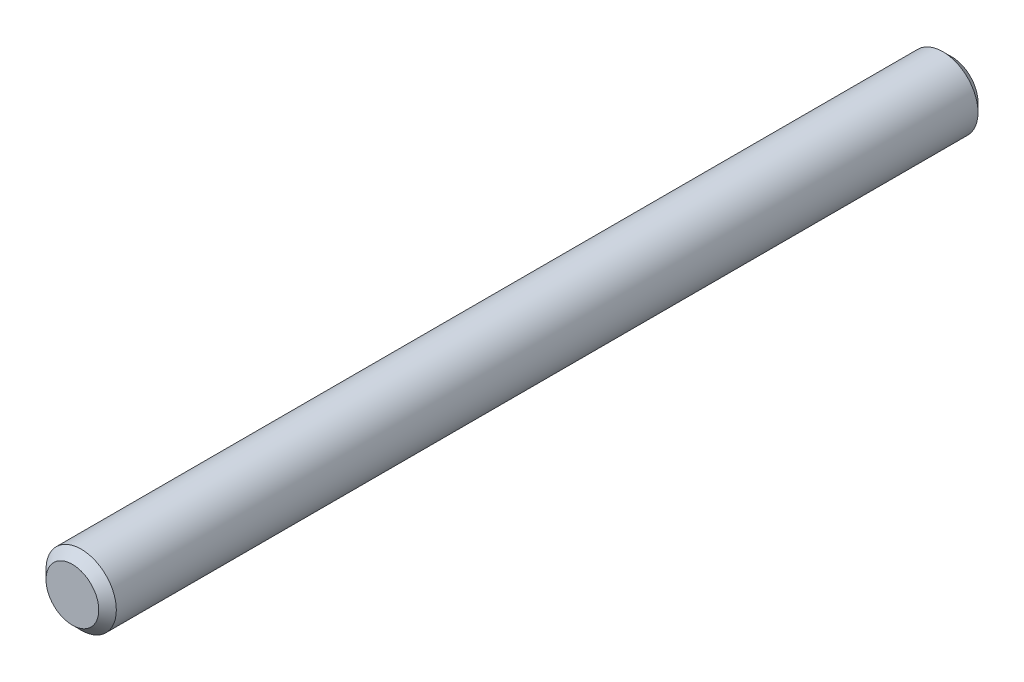
ISO-10303-21;
HEADER;
FILE_DESCRIPTION(('STEP AP214'),'2;1');
FILE_NAME('part.step','',(''),(''),'','','');
FILE_SCHEMA(('AUTOMOTIVE_DESIGN { 1 0 10303 214 1 1 1 1 }'));
ENDSEC;
DATA;
#1=APPLICATION_CONTEXT('core data for automotive mechanical design processes');
#2=APPLICATION_PROTOCOL_DEFINITION('international standard','automotive_design',2000,#1);
#3=PRODUCT_CONTEXT('',#1,'mechanical');
#4=PRODUCT('Part','Part','',(#3));
#5=PRODUCT_RELATED_PRODUCT_CATEGORY('part','',(#4));
#6=PRODUCT_DEFINITION_FORMATION('','',#4);
#7=PRODUCT_DEFINITION_CONTEXT('part definition',#1,'design');
#8=PRODUCT_DEFINITION('design','',#6,#7);
#9=PRODUCT_DEFINITION_SHAPE('','',#8);
#10=(LENGTH_UNIT() NAMED_UNIT(*) SI_UNIT(.MILLI.,.METRE.));
#11=(NAMED_UNIT(*) PLANE_ANGLE_UNIT() SI_UNIT($,.RADIAN.));
#12=(NAMED_UNIT(*) SI_UNIT($,.STERADIAN.) SOLID_ANGLE_UNIT());
#13=UNCERTAINTY_MEASURE_WITH_UNIT(LENGTH_MEASURE(1.E-05),#10,'distance_accuracy_value','');
#14=(GEOMETRIC_REPRESENTATION_CONTEXT(3) GLOBAL_UNCERTAINTY_ASSIGNED_CONTEXT((#13)) GLOBAL_UNIT_ASSIGNED_CONTEXT((#10,
#11,#12)) REPRESENTATION_CONTEXT('',''));
#15=CARTESIAN_POINT('',(0.,0.,0.));
#16=DIRECTION('',(0.,0.,1.));
#17=DIRECTION('',(1.,0.,0.));
#18=AXIS2_PLACEMENT_3D('',#15,#16,#17);
#19=CARTESIAN_POINT('',(0.,0.,25.));
#20=DIRECTION('',(0.,0.,-1.));
#21=DIRECTION('',(-1.,0.,0.));
#22=AXIS2_PLACEMENT_3D('',#19,#20,#21);
#23=CYLINDRICAL_SURFACE('',#22,2.);
#24=CARTESIAN_POINT('',(0.,0.,-24.5));
#25=DIRECTION('',(0.,0.,1.));
#26=DIRECTION('',(1.,0.,0.));
#27=AXIS2_PLACEMENT_3D('',#24,#25,#26);
#28=CIRCLE('',#27,2.);
#29=CARTESIAN_POINT('',(2.,0.,-24.5));
#30=VERTEX_POINT('',#29);
#31=EDGE_CURVE('E49',#30,#30,#28,.T.);
#32=ORIENTED_EDGE('',*,*,#31,.T.);
#33=EDGE_LOOP('',(#32));
#34=FACE_BOUND('',#33,.T.);
#35=CARTESIAN_POINT('',(0.,0.,24.5));
#36=DIRECTION('',(0.,0.,1.));
#37=DIRECTION('',(1.,0.,0.));
#38=AXIS2_PLACEMENT_3D('',#35,#36,#37);
#39=CIRCLE('',#38,2.);
#40=CARTESIAN_POINT('',(2.,0.,24.5));
#41=VERTEX_POINT('',#40);
#42=EDGE_CURVE('E53',#41,#41,#39,.F.);
#43=ORIENTED_EDGE('',*,*,#42,.T.);
#44=EDGE_LOOP('',(#43));
#45=FACE_BOUND('',#44,.T.);
#46=ADVANCED_FACE('F37',(#34,#45),#23,.T.);
#47=CARTESIAN_POINT('',(0.,0.,25.));
#48=DIRECTION('',(0.,0.,1.));
#49=DIRECTION('',(1.,0.,0.));
#50=AXIS2_PLACEMENT_3D('',#47,#48,#49);
#51=PLANE('',#50);
#52=CARTESIAN_POINT('',(0.,0.,25.));
#53=DIRECTION('',(0.,0.,1.));
#54=DIRECTION('',(1.,0.,0.));
#55=AXIS2_PLACEMENT_3D('',#52,#53,#54);
#56=CIRCLE('',#55,1.50000000000001);
#57=CARTESIAN_POINT('',(1.50000000000001,0.,25.));
#58=VERTEX_POINT('',#57);
#59=EDGE_CURVE('E10',#58,#58,#56,.T.);
#60=ORIENTED_EDGE('',*,*,#59,.T.);
#61=EDGE_LOOP('',(#60));
#62=FACE_BOUND('',#61,.T.);
#63=ADVANCED_FACE('F69',(#62),#51,.T.);
#64=CARTESIAN_POINT('',(0.,0.,-25.));
#65=DIRECTION('',(0.,0.,1.));
#66=DIRECTION('',(1.,0.,0.));
#67=AXIS2_PLACEMENT_3D('',#64,#65,#66);
#68=PLANE('',#67);
#69=CARTESIAN_POINT('',(0.,0.,-25.));
#70=DIRECTION('',(0.,0.,1.));
#71=DIRECTION('',(1.,0.,0.));
#72=AXIS2_PLACEMENT_3D('',#69,#70,#71);
#73=CIRCLE('',#72,1.49999999999999);
#74=CARTESIAN_POINT('',(1.49999999999999,0.,-25.));
#75=VERTEX_POINT('',#74);
#76=EDGE_CURVE('E45',#75,#75,#73,.F.);
#77=ORIENTED_EDGE('',*,*,#76,.T.);
#78=EDGE_LOOP('',(#77));
#79=FACE_BOUND('',#78,.T.);
#80=ADVANCED_FACE('F66',(#79),#68,.F.);
#81=CARTESIAN_POINT('',(0.,0.,-24.5));
#82=DIRECTION('',(0.,0.,1.));
#83=DIRECTION('',(1.,0.,0.));
#84=AXIS2_PLACEMENT_3D('',#81,#82,#83);
#85=CONICAL_SURFACE('',#84,2.,0.785398163397453);
#86=ORIENTED_EDGE('',*,*,#76,.F.);
#87=EDGE_LOOP('',(#86));
#88=FACE_BOUND('',#87,.T.);
#89=ORIENTED_EDGE('',*,*,#31,.F.);
#90=EDGE_LOOP('',(#89));
#91=FACE_BOUND('',#90,.T.);
#92=ADVANCED_FACE('F62',(#88,#91),#85,.T.);
#93=CARTESIAN_POINT('',(0.,0.,25.));
#94=DIRECTION('',(0.,0.,-1.));
#95=DIRECTION('',(-1.,0.,0.));
#96=AXIS2_PLACEMENT_3D('',#93,#94,#95);
#97=CONICAL_SURFACE('',#96,1.50000000000001,0.78539816339744);
#98=ORIENTED_EDGE('',*,*,#42,.F.);
#99=EDGE_LOOP('',(#98));
#100=FACE_BOUND('',#99,.T.);
#101=ORIENTED_EDGE('',*,*,#59,.F.);
#102=EDGE_LOOP('',(#101));
#103=FACE_BOUND('',#102,.T.);
#104=ADVANCED_FACE('F40',(#100,#103),#97,.T.);
#105=CLOSED_SHELL('',(#46,#63,#80,#92,#104));
#106=MANIFOLD_SOLID_BREP('B2',#105);
#107=ADVANCED_BREP_SHAPE_REPRESENTATION('',(#18,#106),#14);
#108=SHAPE_DEFINITION_REPRESENTATION(#9,#107);
ENDSEC;
END-ISO-10303-21;
